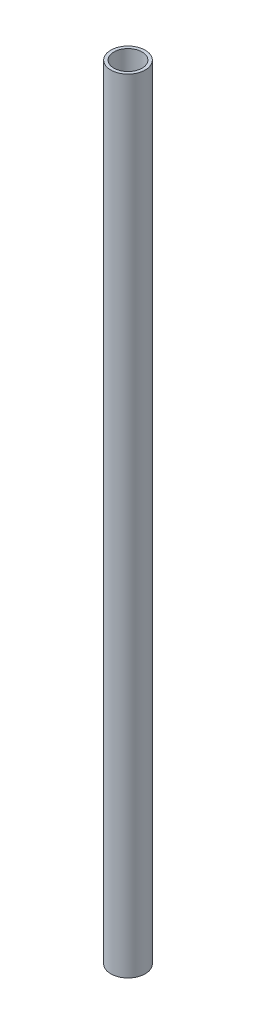
ISO-10303-21;
HEADER;
FILE_DESCRIPTION(('STEP AP214'),'2;1');
FILE_NAME('part.step','',(''),(''),'','','');
FILE_SCHEMA(('AUTOMOTIVE_DESIGN { 1 0 10303 214 1 1 1 1 }'));
ENDSEC;
DATA;
#1=APPLICATION_CONTEXT('core data for automotive mechanical design processes');
#2=APPLICATION_PROTOCOL_DEFINITION('international standard','automotive_design',2000,#1);
#3=PRODUCT_CONTEXT('',#1,'mechanical');
#4=PRODUCT('Part','Part','',(#3));
#5=PRODUCT_RELATED_PRODUCT_CATEGORY('part','',(#4));
#6=PRODUCT_DEFINITION_FORMATION('','',#4);
#7=PRODUCT_DEFINITION_CONTEXT('part definition',#1,'design');
#8=PRODUCT_DEFINITION('design','',#6,#7);
#9=PRODUCT_DEFINITION_SHAPE('','',#8);
#10=(LENGTH_UNIT() NAMED_UNIT(*) SI_UNIT(.MILLI.,.METRE.));
#11=(NAMED_UNIT(*) PLANE_ANGLE_UNIT() SI_UNIT($,.RADIAN.));
#12=(NAMED_UNIT(*) SI_UNIT($,.STERADIAN.) SOLID_ANGLE_UNIT());
#13=UNCERTAINTY_MEASURE_WITH_UNIT(LENGTH_MEASURE(1.E-05),#10,'distance_accuracy_value','');
#14=(GEOMETRIC_REPRESENTATION_CONTEXT(3) GLOBAL_UNCERTAINTY_ASSIGNED_CONTEXT((#13)) GLOBAL_UNIT_ASSIGNED_CONTEXT((#10,
#11,#12)) REPRESENTATION_CONTEXT('',''));
#15=CARTESIAN_POINT('',(0.,0.,0.));
#16=DIRECTION('',(0.,0.,1.));
#17=DIRECTION('',(1.,0.,0.));
#18=AXIS2_PLACEMENT_3D('',#15,#16,#17);
#19=CARTESIAN_POINT('',(0.,20.,0.));
#20=DIRECTION('',(0.,-1.,0.));
#21=DIRECTION('',(0.,0.,-1.));
#22=AXIS2_PLACEMENT_3D('',#19,#20,#21);
#23=CYLINDRICAL_SURFACE('',#22,11.);
#24=CARTESIAN_POINT('',(0.,0.,0.));
#25=DIRECTION('',(0.,1.,0.));
#26=DIRECTION('',(0.,0.,1.));
#27=AXIS2_PLACEMENT_3D('',#24,#25,#26);
#28=CIRCLE('',#27,11.);
#29=CARTESIAN_POINT('',(0.,0.,11.));
#30=VERTEX_POINT('',#29);
#31=EDGE_CURVE('E10',#30,#30,#28,.T.);
#32=ORIENTED_EDGE('',*,*,#31,.T.);
#33=EDGE_LOOP('',(#32));
#34=FACE_BOUND('',#33,.T.);
#35=CARTESIAN_POINT('',(0.,500.,0.));
#36=DIRECTION('',(0.,1.,0.));
#37=DIRECTION('',(0.,0.,1.));
#38=AXIS2_PLACEMENT_3D('',#35,#36,#37);
#39=CIRCLE('',#38,11.);
#40=CARTESIAN_POINT('',(0.,500.,11.));
#41=VERTEX_POINT('',#40);
#42=EDGE_CURVE('E41',#41,#41,#39,.T.);
#43=ORIENTED_EDGE('',*,*,#42,.F.);
#44=EDGE_LOOP('',(#43));
#45=FACE_BOUND('',#44,.T.);
#46=ADVANCED_FACE('F35',(#34,#45),#23,.T.);
#47=CARTESIAN_POINT('',(0.,0.,0.));
#48=DIRECTION('',(0.,1.,0.));
#49=DIRECTION('',(0.,0.,1.));
#50=AXIS2_PLACEMENT_3D('',#47,#48,#49);
#51=PLANE('',#50);
#52=CARTESIAN_POINT('',(0.,0.,0.));
#53=DIRECTION('',(0.,-1.,0.));
#54=DIRECTION('',(0.,0.,-1.));
#55=AXIS2_PLACEMENT_3D('',#52,#53,#54);
#56=CIRCLE('',#55,9.);
#57=CARTESIAN_POINT('',(0.,0.,-9.));
#58=VERTEX_POINT('',#57);
#59=EDGE_CURVE('E49',#58,#58,#56,.T.);
#60=ORIENTED_EDGE('',*,*,#59,.F.);
#61=EDGE_LOOP('',(#60));
#62=FACE_BOUND('',#61,.T.);
#63=ORIENTED_EDGE('',*,*,#31,.F.);
#64=EDGE_LOOP('',(#63));
#65=FACE_BOUND('',#64,.T.);
#66=ADVANCED_FACE('F57',(#62,#65),#51,.F.);
#67=CARTESIAN_POINT('',(0.,500.,0.));
#68=DIRECTION('',(0.,1.,0.));
#69=DIRECTION('',(0.,0.,1.));
#70=AXIS2_PLACEMENT_3D('',#67,#68,#69);
#71=PLANE('',#70);
#72=CARTESIAN_POINT('',(0.,500.,0.));
#73=DIRECTION('',(0.,-1.,0.));
#74=DIRECTION('',(0.,0.,-1.));
#75=AXIS2_PLACEMENT_3D('',#72,#73,#74);
#76=CIRCLE('',#75,9.);
#77=CARTESIAN_POINT('',(0.,500.,-9.));
#78=VERTEX_POINT('',#77);
#79=EDGE_CURVE('E45',#78,#78,#76,.T.);
#80=ORIENTED_EDGE('',*,*,#79,.T.);
#81=EDGE_LOOP('',(#80));
#82=FACE_BOUND('',#81,.T.);
#83=ORIENTED_EDGE('',*,*,#42,.T.);
#84=EDGE_LOOP('',(#83));
#85=FACE_BOUND('',#84,.T.);
#86=ADVANCED_FACE('F60',(#82,#85),#71,.T.);
#87=CARTESIAN_POINT('',(0.,500.,0.));
#88=DIRECTION('',(0.,-1.,0.));
#89=DIRECTION('',(0.,0.,-1.));
#90=AXIS2_PLACEMENT_3D('',#87,#88,#89);
#91=CYLINDRICAL_SURFACE('',#90,9.);
#92=ORIENTED_EDGE('',*,*,#79,.F.);
#93=EDGE_LOOP('',(#92));
#94=FACE_BOUND('',#93,.T.);
#95=ORIENTED_EDGE('',*,*,#59,.T.);
#96=EDGE_LOOP('',(#95));
#97=FACE_BOUND('',#96,.T.);
#98=ADVANCED_FACE('F55',(#94,#97),#91,.F.);
#99=CLOSED_SHELL('',(#46,#66,#86,#98));
#100=MANIFOLD_SOLID_BREP('B2',#99);
#101=ADVANCED_BREP_SHAPE_REPRESENTATION('',(#18,#100),#14);
#102=SHAPE_DEFINITION_REPRESENTATION(#9,#101);
ENDSEC;
END-ISO-10303-21;
